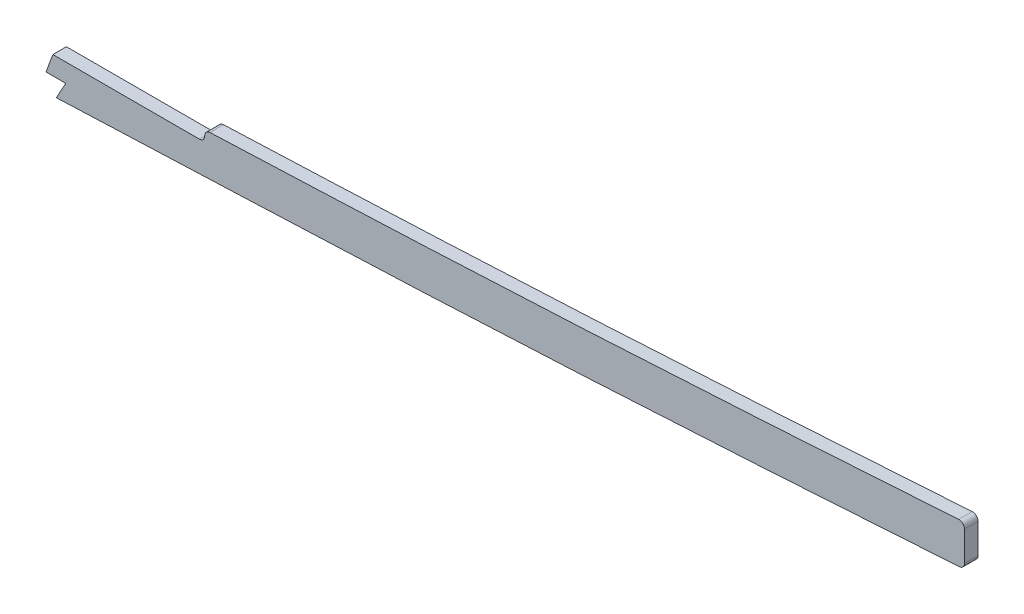
ISO-10303-21;
HEADER;
FILE_DESCRIPTION(('STEP AP214'),'2;1');
FILE_NAME('part.step','',(''),(''),'','','');
FILE_SCHEMA(('AUTOMOTIVE_DESIGN { 1 0 10303 214 1 1 1 1 }'));
ENDSEC;
DATA;
#1=APPLICATION_CONTEXT('core data for automotive mechanical design processes');
#2=APPLICATION_PROTOCOL_DEFINITION('international standard','automotive_design',2000,#1);
#3=PRODUCT_CONTEXT('',#1,'mechanical');
#4=PRODUCT('Part','Part','',(#3));
#5=PRODUCT_RELATED_PRODUCT_CATEGORY('part','',(#4));
#6=PRODUCT_DEFINITION_FORMATION('','',#4);
#7=PRODUCT_DEFINITION_CONTEXT('part definition',#1,'design');
#8=PRODUCT_DEFINITION('design','',#6,#7);
#9=PRODUCT_DEFINITION_SHAPE('','',#8);
#10=(LENGTH_UNIT() NAMED_UNIT(*) SI_UNIT(.MILLI.,.METRE.));
#11=(NAMED_UNIT(*) PLANE_ANGLE_UNIT() SI_UNIT($,.RADIAN.));
#12=(NAMED_UNIT(*) SI_UNIT($,.STERADIAN.) SOLID_ANGLE_UNIT());
#13=UNCERTAINTY_MEASURE_WITH_UNIT(LENGTH_MEASURE(1.E-05),#10,'distance_accuracy_value','');
#14=(GEOMETRIC_REPRESENTATION_CONTEXT(3) GLOBAL_UNCERTAINTY_ASSIGNED_CONTEXT((#13)) GLOBAL_UNIT_ASSIGNED_CONTEXT((#10,
#11,#12)) REPRESENTATION_CONTEXT('',''));
#15=CARTESIAN_POINT('',(0.,0.,0.));
#16=DIRECTION('',(0.,0.,1.));
#17=DIRECTION('',(1.,0.,0.));
#18=AXIS2_PLACEMENT_3D('',#15,#16,#17);
#19=CARTESIAN_POINT('',(2699.79233294449,-7.52454325644929,3.175));
#20=CARTESIAN_POINT('',(2639.63682069028,-11.6572294058032,3.175));
#21=CARTESIAN_POINT('',(2579.48130742255,-15.435846921513,3.175));
#22=CARTESIAN_POINT('',(2518.49810546626,-19.1485286488731,3.175));
#23=CARTESIAN_POINT('',(2436.3555443117,-23.2523639114786,3.175));
#24=CARTESIAN_POINT('',(2354.21298315715,-26.6314864233564,3.175));
#25=CARTESIAN_POINT('',(2332.5703304682,-27.4809881692809,3.175));
#26=CARTESIAN_POINT('',(2156.26863942885,-34.3777685431634,3.175));
#27=CARTESIAN_POINT('',(1979.96694737597,-41.6286312484567,3.175));
#28=CARTESIAN_POINT('',(1824.11427763497,-52.7712658766203,3.175));
#29=CARTESIAN_POINT('',(1636.92860677809,-53.5795698486924,3.175));
#30=CARTESIAN_POINT('',(1449.7429359212,-53.4540246131279,3.175));
#31=CARTESIAN_POINT('',(1418.00673093479,-53.4707027968771,3.175));
#32=CARTESIAN_POINT('',(1324.89933614602,-53.4707027968771,3.175));
#33=CARTESIAN_POINT('',(1231.79194034372,-53.4707027968771,3.175));
#34=CARTESIAN_POINT('',(1170.4412693194,-53.4707027968771,3.175));
#35=CARTESIAN_POINT('',(1108.78407581299,-53.4707027968771,3.175));
#36=CARTESIAN_POINT('',(1047.12688234629,-53.4707027968771,3.175));
#37=CARTESIAN_POINT('',(1046.84641418849,-53.4707027968771,3.175));
#38=CARTESIAN_POINT('',(1046.56594718406,-53.4707027968771,3.175));
#39=CARTESIAN_POINT('',(1046.28548189005,-53.4707027968771,3.175));
#40=(BOUNDED_CURVE() B_SPLINE_CURVE(5,(#19,#20,#21,#22,#23,#24,#25,#26,#27,#28,#29,#30,#31,#32,
#33,#34,#35,#36,#37,#38,#39),.UNSPECIFIED.,.F.,.F.) B_SPLINE_CURVE_WITH_KNOTS((6,3,3,3,3,3,6),
(100.654804519159,130.927896619159,141.337054719159,218.101815019159,233.772059419159,
264.077723219159,264.2162088),
.UNSPECIFIED.) CURVE() GEOMETRIC_REPRESENTATION_ITEM() RATIONAL_B_SPLINE_CURVE((1.,1.,1.,1.,1.,
1.,1.,1.,1.,1.,1.,1.,1.,1.,1.,1.,1.,1.,1.,1.,1.)) REPRESENTATION_ITEM(''));
#41=DIRECTION('',(0.,0.,-1.));
#42=VECTOR('',#41,1.);
#43=SURFACE_OF_LINEAR_EXTRUSION('',#40,#42);
#44=DIRECTION('',(0.,0.,1.));
#45=VECTOR('',#44,1.);
#46=CARTESIAN_POINT('',(2243.33769015545,-31.006850231288,-4.445));
#47=LINE('',#46,#45);
#48=CARTESIAN_POINT('',(2243.33769015545,-31.006850231288,-3.175));
#49=VERTEX_POINT('',#48);
#50=CARTESIAN_POINT('',(2243.33769015545,-31.006850231288,3.175));
#51=VERTEX_POINT('',#50);
#52=EDGE_CURVE('E126',#49,#51,#47,.T.);
#53=ORIENTED_EDGE('',*,*,#52,.F.);
#54=CARTESIAN_POINT('',(2699.79233294449,-7.52454325644929,-3.175));
#55=CARTESIAN_POINT('',(2639.63682069028,-11.6572294058032,-3.175));
#56=CARTESIAN_POINT('',(2579.48130742255,-15.435846921513,-3.175));
#57=CARTESIAN_POINT('',(2518.49810546626,-19.1485286488731,-3.175));
#58=CARTESIAN_POINT('',(2436.3555443117,-23.2523639114786,-3.175));
#59=CARTESIAN_POINT('',(2354.21298315715,-26.6314864233564,-3.175));
#60=CARTESIAN_POINT('',(2332.5703304682,-27.4809881692809,-3.175));
#61=CARTESIAN_POINT('',(2156.26863942885,-34.3777685431634,-3.175));
#62=CARTESIAN_POINT('',(1979.96694737597,-41.6286312484567,-3.175));
#63=CARTESIAN_POINT('',(1824.11427763497,-52.7712658766203,-3.175));
#64=CARTESIAN_POINT('',(1636.92860677809,-53.5795698486924,-3.175));
#65=CARTESIAN_POINT('',(1449.7429359212,-53.4540246131279,-3.175));
#66=CARTESIAN_POINT('',(1418.00673093479,-53.4707027968771,-3.175));
#67=CARTESIAN_POINT('',(1324.89933614602,-53.4707027968771,-3.175));
#68=CARTESIAN_POINT('',(1231.79194034372,-53.4707027968771,-3.175));
#69=CARTESIAN_POINT('',(1170.4412693194,-53.4707027968771,-3.175));
#70=CARTESIAN_POINT('',(1108.78407581299,-53.4707027968771,-3.175));
#71=CARTESIAN_POINT('',(1047.12688234629,-53.4707027968771,-3.175));
#72=CARTESIAN_POINT('',(1046.84641418849,-53.4707027968771,-3.175));
#73=CARTESIAN_POINT('',(1046.56594718406,-53.4707027968771,-3.175));
#74=CARTESIAN_POINT('',(1046.28548189005,-53.4707027968771,-3.175));
#75=(BOUNDED_CURVE() B_SPLINE_CURVE(5,(#54,#55,#56,#57,#58,#59,#60,#61,#62,#63,#64,#65,#66,#67,
#68,#69,#70,#71,#72,#73,#74),.UNSPECIFIED.,.F.,.F.) B_SPLINE_CURVE_WITH_KNOTS((6,3,3,3,3,3,6),
(100.654804519159,130.927896619159,141.337054719159,218.101815019159,233.772059419159,
264.077723219159,264.2162088),
.UNSPECIFIED.) CURVE() GEOMETRIC_REPRESENTATION_ITEM() RATIONAL_B_SPLINE_CURVE((1.,1.,1.,1.,1.,
1.,1.,1.,1.,1.,1.,1.,1.,1.,1.,1.,1.,1.,1.,1.,1.)) REPRESENTATION_ITEM(''));
#76=CARTESIAN_POINT('',(2667.16817968286,-9.72662780264415,-3.175));
#77=VERTEX_POINT('',#76);
#78=EDGE_CURVE('E206',#77,#49,#75,.T.);
#79=ORIENTED_EDGE('',*,*,#78,.F.);
#80=DIRECTION('',(0.,0.,-1.));
#81=VECTOR('',#80,1.);
#82=CARTESIAN_POINT('',(2667.16817968286,-9.72662780264416,-3.175));
#83=LINE('',#82,#81);
#84=CARTESIAN_POINT('',(2667.16817968286,-9.72662780264415,3.175));
#85=VERTEX_POINT('',#84);
#86=EDGE_CURVE('E146',#77,#85,#83,.F.);
#87=ORIENTED_EDGE('',*,*,#86,.T.);
#88=EDGE_CURVE('E140',#85,#51,#40,.T.);
#89=ORIENTED_EDGE('',*,*,#88,.T.);
#90=EDGE_LOOP('',(#53,#79,#87,#89));
#91=FACE_BOUND('',#90,.T.);
#92=ADVANCED_FACE('F36',(#91),#43,.T.);
#93=CARTESIAN_POINT('',(2669.54,6.20943054630084E-11,3.175));
#94=DIRECTION('',(1.,0.,0.));
#95=DIRECTION('',(0.,1.,0.));
#96=AXIS2_PLACEMENT_3D('',#93,#94,#95);
#97=PLANE('',#96);
#98=DIRECTION('',(0.,-1.,0.));
#99=VECTOR('',#98,1.);
#100=CARTESIAN_POINT('',(2669.54,6.20943054630084E-11,3.175));
#101=LINE('',#100,#99);
#102=CARTESIAN_POINT('',(2669.54,6.80855234727927,3.175));
#103=VERTEX_POINT('',#102);
#104=CARTESIAN_POINT('',(2669.54,-7.19220171489328,3.175));
#105=VERTEX_POINT('',#104);
#106=EDGE_CURVE('E147',#103,#105,#101,.T.);
#107=ORIENTED_EDGE('',*,*,#106,.T.);
#108=DIRECTION('',(0.,0.,-1.));
#109=VECTOR('',#108,1.);
#110=CARTESIAN_POINT('',(2669.54,-7.19220171489328,3.175));
#111=LINE('',#110,#109);
#112=CARTESIAN_POINT('',(2669.54,-7.19220171489328,-3.175));
#113=VERTEX_POINT('',#112);
#114=EDGE_CURVE('E191',#105,#113,#111,.T.);
#115=ORIENTED_EDGE('',*,*,#114,.T.);
#116=DIRECTION('',(0.,-1.,0.));
#117=VECTOR('',#116,1.);
#118=CARTESIAN_POINT('',(2669.54,6.20943054630084E-11,-3.175));
#119=LINE('',#118,#117);
#120=CARTESIAN_POINT('',(2669.54,6.80855234727927,-3.175));
#121=VERTEX_POINT('',#120);
#122=EDGE_CURVE('E154',#121,#113,#119,.T.);
#123=ORIENTED_EDGE('',*,*,#122,.F.);
#124=DIRECTION('',(0.,0.,1.));
#125=VECTOR('',#124,1.);
#126=CARTESIAN_POINT('',(2669.54,6.80855234727927,3.175));
#127=LINE('',#126,#125);
#128=EDGE_CURVE('E270',#121,#103,#127,.T.);
#129=ORIENTED_EDGE('',*,*,#128,.T.);
#130=EDGE_LOOP('',(#107,#115,#123,#129));
#131=FACE_BOUND('',#130,.T.);
#132=ADVANCED_FACE('F170',(#131),#97,.T.);
#133=CARTESIAN_POINT('',(2698.48667469404,11.4806601503293,3.175));
#134=CARTESIAN_POINT('',(2691.24737670604,10.9833200828121,3.175));
#135=CARTESIAN_POINT('',(2679.19516047804,10.1655376868452,3.175));
#136=CARTESIAN_POINT('',(2662.27652557768,9.03876140898899,3.175));
#137=CARTESIAN_POINT('',(2635.66628230206,7.2924691456857,3.175));
#138=CARTESIAN_POINT('',(2596.85766552893,4.8260568530791,3.175));
#139=CARTESIAN_POINT('',(2545.72974303923,1.75834409257586,3.175));
#140=CARTESIAN_POINT('',(2494.40530570724,-1.09855523520035,3.175));
#141=CARTESIAN_POINT('',(2451.53302226734,-3.26657329681936,3.175));
#142=CARTESIAN_POINT('',(2417.1983167563,-4.86708361008882,3.175));
#143=CARTESIAN_POINT('',(2391.45707691927,-6.00358923536048,3.175));
#144=CARTESIAN_POINT('',(2365.63473630713,-7.08685458139135,3.175));
#145=CARTESIAN_POINT('',(2339.54628467245,-8.13772994402807,3.175));
#146=CARTESIAN_POINT('',(2313.46613297408,-9.16513837136649,3.175));
#147=CARTESIAN_POINT('',(2287.61237548634,-10.1794782148021,3.175));
#148=CARTESIAN_POINT('',(2261.7633474368,-11.2010322967668,3.175));
#149=CARTESIAN_POINT('',(2227.28532971514,-12.5838425566113,3.175));
#150=CARTESIAN_POINT('',(2184.17556939327,-14.3660723604172,3.175));
#151=CARTESIAN_POINT('',(2132.42906611447,-16.6074278682384,3.175));
#152=CARTESIAN_POINT('',(2063.42552339989,-19.708920484548,3.175));
#153=CARTESIAN_POINT('',(1977.17490763451,-23.7005433130483,3.175));
#154=CARTESIAN_POINT('',(1873.73245143151,-28.149389220677,3.175));
#155=CARTESIAN_POINT('',(1770.37461881016,-31.6574686487852,3.175));
#156=CARTESIAN_POINT('',(1667.08568781321,-33.7931175563218,3.175));
#157=CARTESIAN_POINT('',(1581.01109449057,-34.3831888311612,3.175));
#158=CARTESIAN_POINT('',(1512.07397125959,-34.4278026003723,3.175));
#159=CARTESIAN_POINT('',(1443.06151347714,-34.4095104024296,3.175));
#160=CARTESIAN_POINT('',(1356.80092787913,-34.4244328117572,3.175));
#161=CARTESIAN_POINT('',(1218.79462695393,-34.4184647879491,3.175));
#162=CARTESIAN_POINT('',(1115.28902278569,-34.4207027968771,3.175));
#163=CARTESIAN_POINT('',(1046.28548189005,-34.4207027968771,3.175));
#164=B_SPLINE_CURVE_WITH_KNOTS('',3,(#133,#134,#135,#136,#137,#138,#139,#140,#141,#142,#143,
#144,#145,#146,#147,#148,#149,#150,#151,#152,#153,#154,#155,#156,#157,#158,#159,#160,#161,#162,
#163),.UNSPECIFIED.,.F.,.F.,(4,1,1,1,1,1,1,1,1,1,1,1,1,1,1,1,1,1,1,1,1,1,1,1,1,1,1,1,4),
(100.654804519159,102.842388131745,104.300777206802,105.766098402935,110.877392286712,
115.988686170488,121.099980054264,126.21127393804,128.766920879929,131.322567821817,
133.878214763705,136.433861705593,138.989508647481,141.545155589369,144.100802531257,
146.656449473146,151.767743356922,156.879037240698,161.990331124474,172.212918892027,
182.43550665958,192.658094427132,202.880682194685,213.103269962237,218.214563846014,
223.32585772979,233.548445497342,243.771033264895,264.2162088),.UNSPECIFIED.);
#165=DIRECTION('',(0.,0.,-1.));
#166=VECTOR('',#165,1.);
#167=SURFACE_OF_LINEAR_EXTRUSION('',#164,#166);
#168=CARTESIAN_POINT('',(2698.48667469404,11.4806601503293,-3.175));
#169=CARTESIAN_POINT('',(2691.24737670604,10.9833200828121,-3.175));
#170=CARTESIAN_POINT('',(2679.19516047804,10.1655376868452,-3.175));
#171=CARTESIAN_POINT('',(2662.27652557768,9.03876140898899,-3.175));
#172=CARTESIAN_POINT('',(2635.66628230206,7.2924691456857,-3.175));
#173=CARTESIAN_POINT('',(2596.85766552893,4.8260568530791,-3.175));
#174=CARTESIAN_POINT('',(2545.72974303923,1.75834409257586,-3.175));
#175=CARTESIAN_POINT('',(2494.40530570724,-1.09855523520035,-3.175));
#176=CARTESIAN_POINT('',(2451.53302226734,-3.26657329681936,-3.175));
#177=CARTESIAN_POINT('',(2417.1983167563,-4.86708361008882,-3.175));
#178=CARTESIAN_POINT('',(2391.45707691927,-6.00358923536048,-3.175));
#179=CARTESIAN_POINT('',(2365.63473630713,-7.08685458139135,-3.175));
#180=CARTESIAN_POINT('',(2339.54628467245,-8.13772994402807,-3.175));
#181=CARTESIAN_POINT('',(2313.46613297408,-9.16513837136649,-3.175));
#182=CARTESIAN_POINT('',(2287.61237548634,-10.1794782148021,-3.175));
#183=CARTESIAN_POINT('',(2261.7633474368,-11.2010322967668,-3.175));
#184=CARTESIAN_POINT('',(2227.28532971514,-12.5838425566113,-3.175));
#185=CARTESIAN_POINT('',(2184.17556939327,-14.3660723604172,-3.175));
#186=CARTESIAN_POINT('',(2132.42906611447,-16.6074278682384,-3.175));
#187=CARTESIAN_POINT('',(2063.42552339989,-19.708920484548,-3.175));
#188=CARTESIAN_POINT('',(1977.17490763451,-23.7005433130483,-3.175));
#189=CARTESIAN_POINT('',(1873.73245143151,-28.149389220677,-3.175));
#190=CARTESIAN_POINT('',(1770.37461881016,-31.6574686487852,-3.175));
#191=CARTESIAN_POINT('',(1667.08568781321,-33.7931175563218,-3.175));
#192=CARTESIAN_POINT('',(1581.01109449057,-34.3831888311612,-3.175));
#193=CARTESIAN_POINT('',(1512.07397125959,-34.4278026003723,-3.175));
#194=CARTESIAN_POINT('',(1443.06151347714,-34.4095104024296,-3.175));
#195=CARTESIAN_POINT('',(1356.80092787913,-34.4244328117572,-3.175));
#196=CARTESIAN_POINT('',(1218.79462695393,-34.4184647879491,-3.175));
#197=CARTESIAN_POINT('',(1115.28902278569,-34.4207027968771,-3.175));
#198=CARTESIAN_POINT('',(1046.28548189005,-34.4207027968771,-3.175));
#199=B_SPLINE_CURVE_WITH_KNOTS('',3,(#168,#169,#170,#171,#172,#173,#174,#175,#176,#177,#178,
#179,#180,#181,#182,#183,#184,#185,#186,#187,#188,#189,#190,#191,#192,#193,#194,#195,#196,#197,
#198),.UNSPECIFIED.,.F.,.F.,(4,1,1,1,1,1,1,1,1,1,1,1,1,1,1,1,1,1,1,1,1,1,1,1,1,1,1,1,4),
(100.654804519159,102.842388131745,104.300777206802,105.766098402935,110.877392286712,
115.988686170488,121.099980054264,126.21127393804,128.766920879929,131.322567821817,
133.878214763705,136.433861705593,138.989508647481,141.545155589369,144.100802531257,
146.656449473146,151.767743356922,156.879037240698,161.990331124474,172.212918892027,
182.43550665958,192.658094427132,202.880682194685,213.103269962237,218.214563846014,
223.32585772979,233.548445497342,243.771033264895,264.2162088),.UNSPECIFIED.);
#200=CARTESIAN_POINT('',(2666.83166628409,9.34296820898966,-3.175));
#201=VERTEX_POINT('',#200);
#202=CARTESIAN_POINT('',(2315.42768343168,-9.0873138855109,-3.175));
#203=VERTEX_POINT('',#202);
#204=EDGE_CURVE('E148',#201,#203,#199,.T.);
#205=ORIENTED_EDGE('',*,*,#204,.T.);
#206=DIRECTION('',(0.,0.,-1.));
#207=VECTOR('',#206,1.);
#208=CARTESIAN_POINT('',(2315.42768343168,-9.08731388551089,-3.175));
#209=LINE('',#208,#207);
#210=CARTESIAN_POINT('',(2315.42768343168,-9.0873138855109,3.175));
#211=VERTEX_POINT('',#210);
#212=EDGE_CURVE('E198',#203,#211,#209,.F.);
#213=ORIENTED_EDGE('',*,*,#212,.T.);
#214=CARTESIAN_POINT('',(2666.83166628408,9.34296820898867,3.175));
#215=VERTEX_POINT('',#214);
#216=EDGE_CURVE('E151',#215,#211,#164,.T.);
#217=ORIENTED_EDGE('',*,*,#216,.F.);
#218=DIRECTION('',(0.,0.,-1.));
#219=VECTOR('',#218,1.);
#220=CARTESIAN_POINT('',(2666.83166628409,9.34296820898966,3.175));
#221=LINE('',#220,#219);
#222=EDGE_CURVE('E246',#215,#201,#221,.T.);
#223=ORIENTED_EDGE('',*,*,#222,.T.);
#224=EDGE_LOOP('',(#205,#213,#217,#223));
#225=FACE_BOUND('',#224,.T.);
#226=ADVANCED_FACE('F302',(#225),#167,.F.);
#227=CARTESIAN_POINT('',(0.,0.,3.175));
#228=DIRECTION('',(0.,0.,1.));
#229=DIRECTION('',(1.,0.,0.));
#230=AXIS2_PLACEMENT_3D('',#227,#228,#229);
#231=PLANE('',#230);
#232=DIRECTION('',(0.348051925699609,0.937475256749101,0.));
#233=VECTOR('',#232,1.);
#234=CARTESIAN_POINT('',(2241.72424439042,-14.2632600319784,3.175));
#235=LINE('',#234,#233);
#236=CARTESIAN_POINT('',(2238.4954326079,-22.9600404009782,3.175));
#237=VERTEX_POINT('',#236);
#238=CARTESIAN_POINT('',(2241.72424438869,-14.2632600366464,3.175));
#239=VERTEX_POINT('',#238);
#240=EDGE_CURVE('E51',#237,#239,#235,.T.);
#241=ORIENTED_EDGE('',*,*,#240,.F.);
#242=DIRECTION('',(-1.,0.,0.));
#243=VECTOR('',#242,1.);
#244=CARTESIAN_POINT('',(2238.4954326079,-22.9600404009782,3.175));
#245=LINE('',#244,#243);
#246=CARTESIAN_POINT('',(2247.77744494471,-22.9600404009782,3.175));
#247=VERTEX_POINT('',#246);
#248=EDGE_CURVE('E143',#247,#237,#245,.T.);
#249=ORIENTED_EDGE('',*,*,#248,.F.);
#250=DIRECTION('',(0.483088651994543,0.875571444437343,0.));
#251=VECTOR('',#250,1.);
#252=CARTESIAN_POINT('',(2247.77744494471,-22.9600404009782,3.175));
#253=LINE('',#252,#251);
#254=EDGE_CURVE('E130',#51,#247,#253,.T.);
#255=ORIENTED_EDGE('',*,*,#254,.F.);
#256=ORIENTED_EDGE('',*,*,#88,.F.);
#257=CARTESIAN_POINT('',(2667.,-7.19220171489334,3.175));
#258=DIRECTION('',(0.,0.,1.));
#259=DIRECTION('',(1.,0.,0.));
#260=AXIS2_PLACEMENT_3D('',#257,#258,#259);
#261=CIRCLE('',#260,2.54);
#262=EDGE_CURVE('E189',#85,#105,#261,.T.);
#263=ORIENTED_EDGE('',*,*,#262,.T.);
#264=ORIENTED_EDGE('',*,*,#106,.F.);
#265=CARTESIAN_POINT('',(2667.,6.80855234727921,3.175));
#266=DIRECTION('',(0.,0.,1.));
#267=DIRECTION('',(1.,0.,0.));
#268=AXIS2_PLACEMENT_3D('',#265,#266,#267);
#269=CIRCLE('',#268,2.54);
#270=EDGE_CURVE('E194',#103,#215,#269,.T.);
#271=ORIENTED_EDGE('',*,*,#270,.T.);
#272=ORIENTED_EDGE('',*,*,#216,.T.);
#273=CARTESIAN_POINT('',(2315.5275,-11.6253518388694,3.175));
#274=DIRECTION('',(0.,0.,1.));
#275=DIRECTION('',(1.,0.,0.));
#276=AXIS2_PLACEMENT_3D('',#273,#274,#275);
#277=CIRCLE('',#276,2.54);
#278=CARTESIAN_POINT('',(2312.9875,-11.6253518388687,3.175));
#279=VERTEX_POINT('',#278);
#280=EDGE_CURVE('E193',#211,#279,#277,.T.);
#281=ORIENTED_EDGE('',*,*,#280,.T.);
#282=DIRECTION('',(2.62257407391769E-13,1.,0.));
#283=VECTOR('',#282,1.);
#284=CARTESIAN_POINT('',(2312.9875,-6.06598105079571E-10,3.175));
#285=LINE('',#284,#283);
#286=CARTESIAN_POINT('',(2312.9875,-11.7232600366469,3.175));
#287=VERTEX_POINT('',#286);
#288=EDGE_CURVE('E218',#287,#279,#285,.T.);
#289=ORIENTED_EDGE('',*,*,#288,.F.);
#290=CARTESIAN_POINT('',(2310.4475,-11.7232600366462,3.175));
#291=DIRECTION('',(0.,0.,1.));
#292=DIRECTION('',(1.,0.,0.));
#293=AXIS2_PLACEMENT_3D('',#290,#291,#292);
#294=CIRCLE('',#293,2.54);
#295=CARTESIAN_POINT('',(2310.4475,-14.2632600366462,3.175));
#296=VERTEX_POINT('',#295);
#297=EDGE_CURVE('E273',#287,#296,#294,.F.);
#298=ORIENTED_EDGE('',*,*,#297,.T.);
#299=DIRECTION('',(1.,0.,0.));
#300=VECTOR('',#299,1.);
#301=CARTESIAN_POINT('',(0.,-14.2632600366532,3.175));
#302=LINE('',#301,#300);
#303=EDGE_CURVE('E215',#239,#296,#302,.T.);
#304=ORIENTED_EDGE('',*,*,#303,.F.);
#305=EDGE_LOOP('',(#241,#249,#255,#256,#263,#264,#271,#272,#281,#289,#298,#304));
#306=FACE_BOUND('',#305,.T.);
#307=ADVANCED_FACE('F139',(#306),#231,.T.);
#308=CARTESIAN_POINT('',(0.,0.,-3.175));
#309=DIRECTION('',(0.,0.,1.));
#310=DIRECTION('',(1.,0.,0.));
#311=AXIS2_PLACEMENT_3D('',#308,#309,#310);
#312=PLANE('',#311);
#313=DIRECTION('',(-1.,0.,0.));
#314=VECTOR('',#313,1.);
#315=CARTESIAN_POINT('',(0.,-22.9600404009782,-3.175));
#316=LINE('',#315,#314);
#317=CARTESIAN_POINT('',(2247.77744494471,-22.9600404009782,-3.175));
#318=VERTEX_POINT('',#317);
#319=CARTESIAN_POINT('',(2238.4954326079,-22.9600404009782,-3.175));
#320=VERTEX_POINT('',#319);
#321=EDGE_CURVE('E11',#318,#320,#316,.T.);
#322=ORIENTED_EDGE('',*,*,#321,.T.);
#323=DIRECTION('',(0.348051925699609,0.937475256749101,0.));
#324=VECTOR('',#323,1.);
#325=CARTESIAN_POINT('',(1974.81540898759,-733.180210412045,-3.175));
#326=LINE('',#325,#324);
#327=CARTESIAN_POINT('',(2241.72424439042,-14.2632600319784,-3.175));
#328=VERTEX_POINT('',#327);
#329=EDGE_CURVE('E219',#320,#328,#326,.T.);
#330=ORIENTED_EDGE('',*,*,#329,.T.);
#331=DIRECTION('',(1.,0.,0.));
#332=VECTOR('',#331,1.);
#333=CARTESIAN_POINT('',(0.,-14.2632600366532,-3.175));
#334=LINE('',#333,#332);
#335=CARTESIAN_POINT('',(2310.4475,-14.2632600366462,-3.175));
#336=VERTEX_POINT('',#335);
#337=EDGE_CURVE('E207',#328,#336,#334,.T.);
#338=ORIENTED_EDGE('',*,*,#337,.T.);
#339=CARTESIAN_POINT('',(2310.4475,-11.7232600366462,-3.175));
#340=DIRECTION('',(0.,0.,1.));
#341=DIRECTION('',(1.,0.,0.));
#342=AXIS2_PLACEMENT_3D('',#339,#340,#341);
#343=CIRCLE('',#342,2.54);
#344=CARTESIAN_POINT('',(2312.9875,-11.7232600366469,-3.175));
#345=VERTEX_POINT('',#344);
#346=EDGE_CURVE('E220',#336,#345,#343,.T.);
#347=ORIENTED_EDGE('',*,*,#346,.T.);
#348=DIRECTION('',(2.62257407391769E-13,1.,0.));
#349=VECTOR('',#348,1.);
#350=CARTESIAN_POINT('',(2312.9875,-6.06598105079571E-10,-3.175));
#351=LINE('',#350,#349);
#352=CARTESIAN_POINT('',(2312.9875,-11.6253518388687,-3.175));
#353=VERTEX_POINT('',#352);
#354=EDGE_CURVE('E202',#345,#353,#351,.T.);
#355=ORIENTED_EDGE('',*,*,#354,.T.);
#356=CARTESIAN_POINT('',(2315.5275,-11.6253518388694,-3.175));
#357=DIRECTION('',(0.,0.,1.));
#358=DIRECTION('',(1.,0.,0.));
#359=AXIS2_PLACEMENT_3D('',#356,#357,#358);
#360=CIRCLE('',#359,2.54);
#361=EDGE_CURVE('E261',#353,#203,#360,.F.);
#362=ORIENTED_EDGE('',*,*,#361,.T.);
#363=ORIENTED_EDGE('',*,*,#204,.F.);
#364=CARTESIAN_POINT('',(2667.,6.80855234727921,-3.175));
#365=DIRECTION('',(0.,0.,1.));
#366=DIRECTION('',(1.,0.,0.));
#367=AXIS2_PLACEMENT_3D('',#364,#365,#366);
#368=CIRCLE('',#367,2.54);
#369=EDGE_CURVE('E262',#201,#121,#368,.F.);
#370=ORIENTED_EDGE('',*,*,#369,.T.);
#371=ORIENTED_EDGE('',*,*,#122,.T.);
#372=CARTESIAN_POINT('',(2667.,-7.19220171489334,-3.175));
#373=DIRECTION('',(0.,0.,1.));
#374=DIRECTION('',(1.,0.,0.));
#375=AXIS2_PLACEMENT_3D('',#372,#373,#374);
#376=CIRCLE('',#375,2.54);
#377=EDGE_CURVE('E59',#113,#77,#376,.F.);
#378=ORIENTED_EDGE('',*,*,#377,.T.);
#379=ORIENTED_EDGE('',*,*,#78,.T.);
#380=DIRECTION('',(0.483088651994543,0.875571444437343,0.));
#381=VECTOR('',#380,1.);
#382=CARTESIAN_POINT('',(1732.91478655638,-956.120112844592,-3.175));
#383=LINE('',#382,#381);
#384=EDGE_CURVE('E44',#49,#318,#383,.T.);
#385=ORIENTED_EDGE('',*,*,#384,.T.);
#386=EDGE_LOOP('',(#322,#330,#338,#347,#355,#362,#363,#370,#371,#378,#379,#385));
#387=FACE_BOUND('',#386,.T.);
#388=ADVANCED_FACE('F224',(#387),#312,.F.);
#389=CARTESIAN_POINT('',(0.,-14.2632600366532,-3.175));
#390=DIRECTION('',(0.,-1.,0.));
#391=DIRECTION('',(1.,0.,0.));
#392=AXIS2_PLACEMENT_3D('',#389,#390,#391);
#393=PLANE('',#392);
#394=ORIENTED_EDGE('',*,*,#337,.F.);
#395=DIRECTION('',(0.,0.,1.));
#396=VECTOR('',#395,1.);
#397=CARTESIAN_POINT('',(2241.72424438869,-14.2632600366464,-3.175));
#398=LINE('',#397,#396);
#399=EDGE_CURVE('E223',#328,#239,#398,.T.);
#400=ORIENTED_EDGE('',*,*,#399,.T.);
#401=ORIENTED_EDGE('',*,*,#303,.T.);
#402=DIRECTION('',(0.,0.,1.));
#403=VECTOR('',#402,1.);
#404=CARTESIAN_POINT('',(2310.4475,-14.2632600366462,-3.175));
#405=LINE('',#404,#403);
#406=EDGE_CURVE('E267',#296,#336,#405,.F.);
#407=ORIENTED_EDGE('',*,*,#406,.T.);
#408=EDGE_LOOP('',(#394,#400,#401,#407));
#409=FACE_BOUND('',#408,.T.);
#410=ADVANCED_FACE('F279',(#409),#393,.F.);
#411=CARTESIAN_POINT('',(2312.9875,-6.06598105079571E-10,-3.175));
#412=DIRECTION('',(1.,-2.62257407391769E-13,0.));
#413=DIRECTION('',(2.62257407391769E-13,1.,0.));
#414=AXIS2_PLACEMENT_3D('',#411,#412,#413);
#415=PLANE('',#414);
#416=ORIENTED_EDGE('',*,*,#288,.T.);
#417=DIRECTION('',(0.,0.,-1.));
#418=VECTOR('',#417,1.);
#419=CARTESIAN_POINT('',(2312.9875,-11.6253518388687,-3.175));
#420=LINE('',#419,#418);
#421=EDGE_CURVE('E256',#279,#353,#420,.T.);
#422=ORIENTED_EDGE('',*,*,#421,.T.);
#423=ORIENTED_EDGE('',*,*,#354,.F.);
#424=DIRECTION('',(0.,0.,1.));
#425=VECTOR('',#424,1.);
#426=CARTESIAN_POINT('',(2312.9875,-11.7232600366469,3.175));
#427=LINE('',#426,#425);
#428=EDGE_CURVE('E196',#345,#287,#427,.T.);
#429=ORIENTED_EDGE('',*,*,#428,.T.);
#430=EDGE_LOOP('',(#416,#422,#423,#429));
#431=FACE_BOUND('',#430,.T.);
#432=ADVANCED_FACE('F176',(#431),#415,.F.);
#433=CARTESIAN_POINT('',(2315.5275,-11.6253518388694,0.));
#434=DIRECTION('',(0.,0.,-1.));
#435=DIRECTION('',(-1.,0.,0.));
#436=AXIS2_PLACEMENT_3D('',#433,#434,#435);
#437=CYLINDRICAL_SURFACE('',#436,2.54);
#438=ORIENTED_EDGE('',*,*,#361,.F.);
#439=ORIENTED_EDGE('',*,*,#421,.F.);
#440=ORIENTED_EDGE('',*,*,#280,.F.);
#441=ORIENTED_EDGE('',*,*,#212,.F.);
#442=EDGE_LOOP('',(#438,#439,#440,#441));
#443=FACE_BOUND('',#442,.T.);
#444=ADVANCED_FACE('F172',(#443),#437,.T.);
#445=CARTESIAN_POINT('',(2310.4475,-11.7232600366462,-3.175));
#446=DIRECTION('',(0.,0.,-1.));
#447=DIRECTION('',(-1.,0.,0.));
#448=AXIS2_PLACEMENT_3D('',#445,#446,#447);
#449=CYLINDRICAL_SURFACE('',#448,2.54);
#450=ORIENTED_EDGE('',*,*,#346,.F.);
#451=ORIENTED_EDGE('',*,*,#406,.F.);
#452=ORIENTED_EDGE('',*,*,#297,.F.);
#453=ORIENTED_EDGE('',*,*,#428,.F.);
#454=EDGE_LOOP('',(#450,#451,#452,#453));
#455=FACE_BOUND('',#454,.T.);
#456=ADVANCED_FACE('F175',(#455),#449,.F.);
#457=CARTESIAN_POINT('',(2667.,-7.19220171489334,0.));
#458=DIRECTION('',(0.,0.,-1.));
#459=DIRECTION('',(-1.,0.,0.));
#460=AXIS2_PLACEMENT_3D('',#457,#458,#459);
#461=CYLINDRICAL_SURFACE('',#460,2.54);
#462=ORIENTED_EDGE('',*,*,#262,.F.);
#463=ORIENTED_EDGE('',*,*,#86,.F.);
#464=ORIENTED_EDGE('',*,*,#377,.F.);
#465=ORIENTED_EDGE('',*,*,#114,.F.);
#466=EDGE_LOOP('',(#462,#463,#464,#465));
#467=FACE_BOUND('',#466,.T.);
#468=ADVANCED_FACE('F179',(#467),#461,.T.);
#469=CARTESIAN_POINT('',(2667.,6.80855234727921,0.));
#470=DIRECTION('',(0.,0.,-1.));
#471=DIRECTION('',(-1.,0.,0.));
#472=AXIS2_PLACEMENT_3D('',#469,#470,#471);
#473=CYLINDRICAL_SURFACE('',#472,2.54);
#474=ORIENTED_EDGE('',*,*,#270,.F.);
#475=ORIENTED_EDGE('',*,*,#128,.F.);
#476=ORIENTED_EDGE('',*,*,#369,.F.);
#477=ORIENTED_EDGE('',*,*,#222,.F.);
#478=EDGE_LOOP('',(#474,#475,#476,#477));
#479=FACE_BOUND('',#478,.T.);
#480=ADVANCED_FACE('F38',(#479),#473,.T.);
#481=CARTESIAN_POINT('',(2238.4954326079,-22.9600404009782,-4.445));
#482=DIRECTION('',(0.,1.,0.));
#483=DIRECTION('',(0.,0.,1.));
#484=AXIS2_PLACEMENT_3D('',#481,#482,#483);
#485=PLANE('',#484);
#486=DIRECTION('',(0.,0.,1.));
#487=VECTOR('',#486,1.);
#488=CARTESIAN_POINT('',(2247.77744494471,-22.9600404009782,-4.445));
#489=LINE('',#488,#487);
#490=EDGE_CURVE('E135',#318,#247,#489,.T.);
#491=ORIENTED_EDGE('',*,*,#490,.T.);
#492=ORIENTED_EDGE('',*,*,#248,.T.);
#493=DIRECTION('',(0.,0.,1.));
#494=VECTOR('',#493,1.);
#495=CARTESIAN_POINT('',(2238.4954326079,-22.9600404009782,-4.445));
#496=LINE('',#495,#494);
#497=EDGE_CURVE('E283',#320,#237,#496,.T.);
#498=ORIENTED_EDGE('',*,*,#497,.F.);
#499=ORIENTED_EDGE('',*,*,#321,.F.);
#500=EDGE_LOOP('',(#491,#492,#498,#499));
#501=FACE_BOUND('',#500,.T.);
#502=ADVANCED_FACE('F186',(#501),#485,.F.);
#503=CARTESIAN_POINT('',(2247.77744494471,-22.9600404009782,-4.445));
#504=DIRECTION('',(0.875571444437343,-0.483088651994543,0.));
#505=DIRECTION('',(0.483088651994543,0.875571444437343,0.));
#506=AXIS2_PLACEMENT_3D('',#503,#504,#505);
#507=PLANE('',#506);
#508=ORIENTED_EDGE('',*,*,#52,.T.);
#509=ORIENTED_EDGE('',*,*,#254,.T.);
#510=ORIENTED_EDGE('',*,*,#490,.F.);
#511=ORIENTED_EDGE('',*,*,#384,.F.);
#512=EDGE_LOOP('',(#508,#509,#510,#511));
#513=FACE_BOUND('',#512,.T.);
#514=ADVANCED_FACE('F128',(#513),#507,.F.);
#515=CARTESIAN_POINT('',(2241.72424439042,-14.2632600319784,-4.445));
#516=DIRECTION('',(0.937475256749101,-0.348051925699609,0.));
#517=DIRECTION('',(0.348051925699609,0.937475256749101,0.));
#518=AXIS2_PLACEMENT_3D('',#515,#516,#517);
#519=PLANE('',#518);
#520=ORIENTED_EDGE('',*,*,#497,.T.);
#521=ORIENTED_EDGE('',*,*,#240,.T.);
#522=ORIENTED_EDGE('',*,*,#399,.F.);
#523=ORIENTED_EDGE('',*,*,#329,.F.);
#524=EDGE_LOOP('',(#520,#521,#522,#523));
#525=FACE_BOUND('',#524,.T.);
#526=ADVANCED_FACE('F286',(#525),#519,.F.);
#527=CLOSED_SHELL('',(#92,#132,#226,#307,#388,#410,#432,#444,#456,#468,#480,#502,#514,#526));
#528=MANIFOLD_SOLID_BREP('B2',#527);
#529=ADVANCED_BREP_SHAPE_REPRESENTATION('',(#18,#528),#14);
#530=SHAPE_DEFINITION_REPRESENTATION(#9,#529);
ENDSEC;
END-ISO-10303-21;
